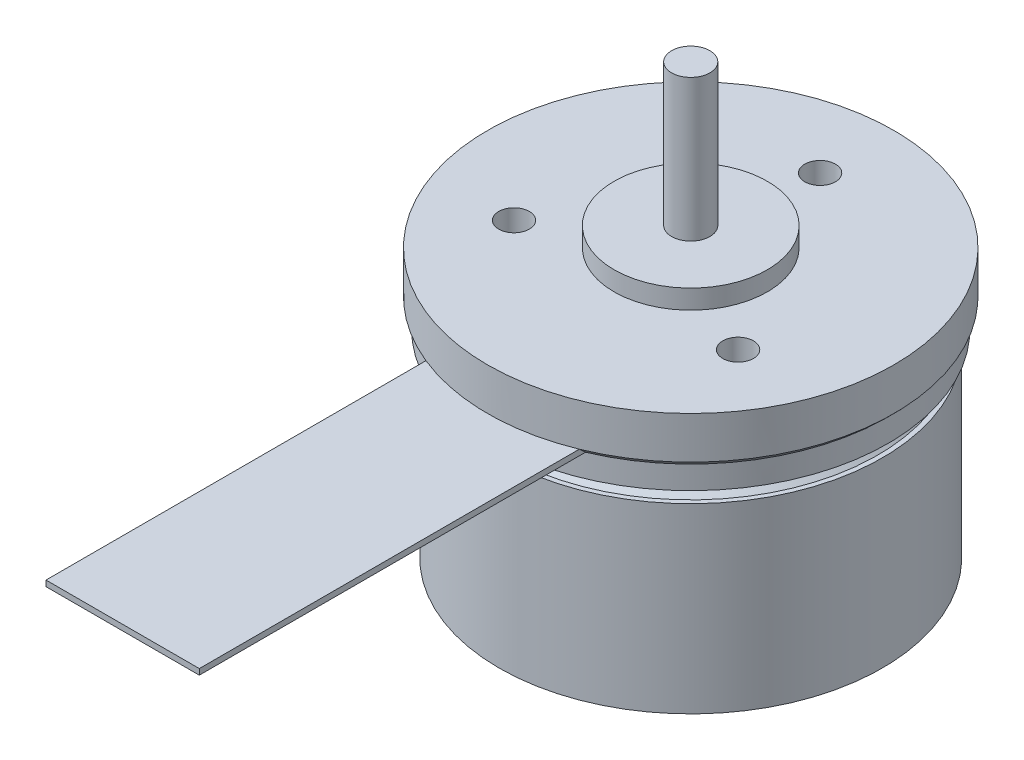
ISO-10303-21;
HEADER;
FILE_DESCRIPTION(('STEP AP214'),'2;1');
FILE_NAME('part.step','',(''),(''),'','','');
FILE_SCHEMA(('AUTOMOTIVE_DESIGN { 1 0 10303 214 1 1 1 1 }'));
ENDSEC;
DATA;
#1=APPLICATION_CONTEXT('core data for automotive mechanical design processes');
#2=APPLICATION_PROTOCOL_DEFINITION('international standard','automotive_design',2000,#1);
#3=PRODUCT_CONTEXT('',#1,'mechanical');
#4=PRODUCT('Part','Part','',(#3));
#5=PRODUCT_RELATED_PRODUCT_CATEGORY('part','',(#4));
#6=PRODUCT_DEFINITION_FORMATION('','',#4);
#7=PRODUCT_DEFINITION_CONTEXT('part definition',#1,'design');
#8=PRODUCT_DEFINITION('design','',#6,#7);
#9=PRODUCT_DEFINITION_SHAPE('','',#8);
#10=(LENGTH_UNIT() NAMED_UNIT(*) SI_UNIT(.MILLI.,.METRE.));
#11=(NAMED_UNIT(*) PLANE_ANGLE_UNIT() SI_UNIT($,.RADIAN.));
#12=(NAMED_UNIT(*) SI_UNIT($,.STERADIAN.) SOLID_ANGLE_UNIT());
#13=UNCERTAINTY_MEASURE_WITH_UNIT(LENGTH_MEASURE(1.E-05),#10,'distance_accuracy_value','');
#14=(GEOMETRIC_REPRESENTATION_CONTEXT(3) GLOBAL_UNCERTAINTY_ASSIGNED_CONTEXT((#13)) GLOBAL_UNIT_ASSIGNED_CONTEXT((#10,
#11,#12)) REPRESENTATION_CONTEXT('',''));
#15=CARTESIAN_POINT('',(0.,0.,0.));
#16=DIRECTION('',(0.,0.,1.));
#17=DIRECTION('',(1.,0.,0.));
#18=AXIS2_PLACEMENT_3D('',#15,#16,#17);
#19=CARTESIAN_POINT('',(0.,2.2,0.));
#20=DIRECTION('',(0.,-1.,0.));
#21=DIRECTION('',(0.,0.,-1.));
#22=AXIS2_PLACEMENT_3D('',#19,#20,#21);
#23=CYLINDRICAL_SURFACE('',#22,10.6);
#24=CARTESIAN_POINT('',(0.,2.2,0.));
#25=DIRECTION('',(0.,1.,0.));
#26=DIRECTION('',(0.,0.,1.));
#27=AXIS2_PLACEMENT_3D('',#24,#25,#26);
#28=CIRCLE('',#27,10.6);
#29=CARTESIAN_POINT('',(0.,2.2,10.6));
#30=VERTEX_POINT('',#29);
#31=EDGE_CURVE('E197',#30,#30,#28,.T.);
#32=ORIENTED_EDGE('',*,*,#31,.F.);
#33=EDGE_LOOP('',(#32));
#34=FACE_BOUND('',#33,.T.);
#35=CARTESIAN_POINT('',(0.,0.,0.));
#36=DIRECTION('',(0.,1.,0.));
#37=DIRECTION('',(0.,0.,1.));
#38=AXIS2_PLACEMENT_3D('',#35,#36,#37);
#39=CIRCLE('',#38,10.6);
#40=CARTESIAN_POINT('',(4.,0.,9.81631295344642));
#41=VERTEX_POINT('',#40);
#42=CARTESIAN_POINT('',(-4.,0.,9.81631295344643));
#43=VERTEX_POINT('',#42);
#44=EDGE_CURVE('E168',#41,#43,#39,.T.);
#45=ORIENTED_EDGE('',*,*,#44,.T.);
#46=EDGE_CURVE('E167',#43,#41,#39,.T.);
#47=ORIENTED_EDGE('',*,*,#46,.T.);
#48=EDGE_LOOP('',(#45,#47));
#49=FACE_BOUND('',#48,.T.);
#50=ADVANCED_FACE('F42',(#34,#49),#23,.T.);
#51=CARTESIAN_POINT('',(5.84567147554539,2.2,3.37499999999975));
#52=DIRECTION('',(0.,-1.,0.));
#53=DIRECTION('',(0.,0.,-1.));
#54=AXIS2_PLACEMENT_3D('',#51,#52,#53);
#55=CYLINDRICAL_SURFACE('',#54,0.800000000000371);
#56=CARTESIAN_POINT('',(5.84567147554539,2.2,3.37499999999975));
#57=DIRECTION('',(0.,1.,0.));
#58=DIRECTION('',(0.,0.,1.));
#59=AXIS2_PLACEMENT_3D('',#56,#57,#58);
#60=CIRCLE('',#59,0.800000000000371);
#61=CARTESIAN_POINT('',(5.84567147554539,2.2,4.17500000000012));
#62=VERTEX_POINT('',#61);
#63=EDGE_CURVE('E193',#62,#62,#60,.T.);
#64=ORIENTED_EDGE('',*,*,#63,.T.);
#65=EDGE_LOOP('',(#64));
#66=FACE_BOUND('',#65,.T.);
#67=CARTESIAN_POINT('',(5.84567147554539,0.,3.37499999999975));
#68=DIRECTION('',(0.,1.,0.));
#69=DIRECTION('',(0.,0.,1.));
#70=AXIS2_PLACEMENT_3D('',#67,#68,#69);
#71=CIRCLE('',#70,0.800000000000371);
#72=CARTESIAN_POINT('',(5.84567147554539,0.,4.17500000000012));
#73=VERTEX_POINT('',#72);
#74=EDGE_CURVE('E190',#73,#73,#71,.T.);
#75=ORIENTED_EDGE('',*,*,#74,.F.);
#76=EDGE_LOOP('',(#75));
#77=FACE_BOUND('',#76,.T.);
#78=ADVANCED_FACE('F274',(#66,#77),#55,.F.);
#79=CARTESIAN_POINT('',(0.,2.2,-6.75));
#80=DIRECTION('',(0.,-1.,0.));
#81=DIRECTION('',(0.,0.,-1.));
#82=AXIS2_PLACEMENT_3D('',#79,#80,#81);
#83=CYLINDRICAL_SURFACE('',#82,0.8);
#84=CARTESIAN_POINT('',(0.,2.2,-6.75));
#85=DIRECTION('',(0.,1.,0.));
#86=DIRECTION('',(0.,0.,1.));
#87=AXIS2_PLACEMENT_3D('',#84,#85,#86);
#88=CIRCLE('',#87,0.8);
#89=CARTESIAN_POINT('',(0.,2.2,-5.95));
#90=VERTEX_POINT('',#89);
#91=EDGE_CURVE('E189',#90,#90,#88,.T.);
#92=ORIENTED_EDGE('',*,*,#91,.T.);
#93=EDGE_LOOP('',(#92));
#94=FACE_BOUND('',#93,.T.);
#95=CARTESIAN_POINT('',(0.,0.,-6.75));
#96=DIRECTION('',(0.,1.,0.));
#97=DIRECTION('',(0.,0.,1.));
#98=AXIS2_PLACEMENT_3D('',#95,#96,#97);
#99=CIRCLE('',#98,0.8);
#100=CARTESIAN_POINT('',(0.,0.,-5.95));
#101=VERTEX_POINT('',#100);
#102=EDGE_CURVE('E207',#101,#101,#99,.T.);
#103=ORIENTED_EDGE('',*,*,#102,.F.);
#104=EDGE_LOOP('',(#103));
#105=FACE_BOUND('',#104,.T.);
#106=ADVANCED_FACE('F280',(#94,#105),#83,.F.);
#107=CARTESIAN_POINT('',(-5.84567147554453,2.2,3.37500000000025));
#108=DIRECTION('',(0.,-1.,0.));
#109=DIRECTION('',(0.,0.,-1.));
#110=AXIS2_PLACEMENT_3D('',#107,#108,#109);
#111=CYLINDRICAL_SURFACE('',#110,0.800000000000547);
#112=CARTESIAN_POINT('',(-5.84567147554453,2.2,3.37500000000025));
#113=DIRECTION('',(0.,1.,0.));
#114=DIRECTION('',(0.,0.,1.));
#115=AXIS2_PLACEMENT_3D('',#112,#113,#114);
#116=CIRCLE('',#115,0.800000000000547);
#117=CARTESIAN_POINT('',(-5.84567147554453,2.2,4.1750000000008));
#118=VERTEX_POINT('',#117);
#119=EDGE_CURVE('E185',#118,#118,#116,.T.);
#120=ORIENTED_EDGE('',*,*,#119,.T.);
#121=EDGE_LOOP('',(#120));
#122=FACE_BOUND('',#121,.T.);
#123=CARTESIAN_POINT('',(-5.84567147554453,0.,3.37500000000025));
#124=DIRECTION('',(0.,1.,0.));
#125=DIRECTION('',(0.,0.,1.));
#126=AXIS2_PLACEMENT_3D('',#123,#124,#125);
#127=CIRCLE('',#126,0.800000000000547);
#128=CARTESIAN_POINT('',(-5.84567147554453,0.,4.1750000000008));
#129=VERTEX_POINT('',#128);
#130=EDGE_CURVE('E184',#129,#129,#127,.T.);
#131=ORIENTED_EDGE('',*,*,#130,.F.);
#132=EDGE_LOOP('',(#131));
#133=FACE_BOUND('',#132,.T.);
#134=ADVANCED_FACE('F44',(#122,#133),#111,.F.);
#135=CARTESIAN_POINT('',(0.,2.2,0.));
#136=DIRECTION('',(0.,1.,0.));
#137=DIRECTION('',(0.,0.,1.));
#138=AXIS2_PLACEMENT_3D('',#135,#136,#137);
#139=PLANE('',#138);
#140=ORIENTED_EDGE('',*,*,#119,.F.);
#141=EDGE_LOOP('',(#140));
#142=FACE_BOUND('',#141,.T.);
#143=ORIENTED_EDGE('',*,*,#91,.F.);
#144=EDGE_LOOP('',(#143));
#145=FACE_BOUND('',#144,.T.);
#146=ORIENTED_EDGE('',*,*,#63,.F.);
#147=EDGE_LOOP('',(#146));
#148=FACE_BOUND('',#147,.T.);
#149=ORIENTED_EDGE('',*,*,#31,.T.);
#150=EDGE_LOOP('',(#149));
#151=FACE_BOUND('',#150,.T.);
#152=CARTESIAN_POINT('',(0.,2.2,0.));
#153=DIRECTION('',(0.,1.,0.));
#154=DIRECTION('',(0.,0.,1.));
#155=AXIS2_PLACEMENT_3D('',#152,#153,#154);
#156=CIRCLE('',#155,4.);
#157=CARTESIAN_POINT('',(0.,2.2,4.));
#158=VERTEX_POINT('',#157);
#159=EDGE_CURVE('E201',#158,#158,#156,.T.);
#160=ORIENTED_EDGE('',*,*,#159,.F.);
#161=EDGE_LOOP('',(#160));
#162=FACE_BOUND('',#161,.T.);
#163=ADVANCED_FACE('F286',(#142,#145,#148,#151,#162),#139,.T.);
#164=CARTESIAN_POINT('',(0.,3.2,0.));
#165=DIRECTION('',(0.,-1.,0.));
#166=DIRECTION('',(0.,0.,-1.));
#167=AXIS2_PLACEMENT_3D('',#164,#165,#166);
#168=CYLINDRICAL_SURFACE('',#167,4.);
#169=ORIENTED_EDGE('',*,*,#159,.T.);
#170=EDGE_LOOP('',(#169));
#171=FACE_BOUND('',#170,.T.);
#172=CARTESIAN_POINT('',(0.,3.2,0.));
#173=DIRECTION('',(0.,1.,0.));
#174=DIRECTION('',(0.,0.,1.));
#175=AXIS2_PLACEMENT_3D('',#172,#173,#174);
#176=CIRCLE('',#175,4.);
#177=CARTESIAN_POINT('',(0.,3.2,4.));
#178=VERTEX_POINT('',#177);
#179=EDGE_CURVE('E180',#178,#178,#176,.T.);
#180=ORIENTED_EDGE('',*,*,#179,.F.);
#181=EDGE_LOOP('',(#180));
#182=FACE_BOUND('',#181,.T.);
#183=ADVANCED_FACE('F317',(#171,#182),#168,.T.);
#184=CARTESIAN_POINT('',(0.,3.2,0.));
#185=DIRECTION('',(0.,1.,0.));
#186=DIRECTION('',(0.,0.,1.));
#187=AXIS2_PLACEMENT_3D('',#184,#185,#186);
#188=PLANE('',#187);
#189=CARTESIAN_POINT('',(0.,3.2,0.));
#190=DIRECTION('',(0.,1.,0.));
#191=DIRECTION('',(0.,0.,1.));
#192=AXIS2_PLACEMENT_3D('',#189,#190,#191);
#193=CIRCLE('',#192,1.);
#194=CARTESIAN_POINT('',(0.,3.2,1.));
#195=VERTEX_POINT('',#194);
#196=EDGE_CURVE('E176',#195,#195,#193,.T.);
#197=ORIENTED_EDGE('',*,*,#196,.F.);
#198=EDGE_LOOP('',(#197));
#199=FACE_BOUND('',#198,.T.);
#200=ORIENTED_EDGE('',*,*,#179,.T.);
#201=EDGE_LOOP('',(#200));
#202=FACE_BOUND('',#201,.T.);
#203=ADVANCED_FACE('F311',(#199,#202),#188,.T.);
#204=CARTESIAN_POINT('',(0.,10.6,0.));
#205=DIRECTION('',(0.,1.,0.));
#206=DIRECTION('',(0.,0.,1.));
#207=AXIS2_PLACEMENT_3D('',#204,#205,#206);
#208=PLANE('',#207);
#209=CARTESIAN_POINT('',(0.,10.6,0.));
#210=DIRECTION('',(0.,1.,0.));
#211=DIRECTION('',(0.,0.,1.));
#212=AXIS2_PLACEMENT_3D('',#209,#210,#211);
#213=CIRCLE('',#212,1.);
#214=CARTESIAN_POINT('',(0.,10.6,1.));
#215=VERTEX_POINT('',#214);
#216=EDGE_CURVE('E172',#215,#215,#213,.T.);
#217=ORIENTED_EDGE('',*,*,#216,.T.);
#218=EDGE_LOOP('',(#217));
#219=FACE_BOUND('',#218,.T.);
#220=ADVANCED_FACE('F308',(#219),#208,.T.);
#221=CARTESIAN_POINT('',(0.,10.6,0.));
#222=DIRECTION('',(0.,-1.,0.));
#223=DIRECTION('',(0.,0.,-1.));
#224=AXIS2_PLACEMENT_3D('',#221,#222,#223);
#225=CYLINDRICAL_SURFACE('',#224,1.);
#226=ORIENTED_EDGE('',*,*,#196,.T.);
#227=EDGE_LOOP('',(#226));
#228=FACE_BOUND('',#227,.T.);
#229=ORIENTED_EDGE('',*,*,#216,.F.);
#230=EDGE_LOOP('',(#229));
#231=FACE_BOUND('',#230,.T.);
#232=ADVANCED_FACE('F231',(#228,#231),#225,.T.);
#233=CARTESIAN_POINT('',(0.,-11.9,-1.));
#234=DIRECTION('',(0.,1.,0.));
#235=DIRECTION('',(0.,0.,1.));
#236=AXIS2_PLACEMENT_3D('',#233,#234,#235);
#237=PLANE('',#236);
#238=CARTESIAN_POINT('',(0.,-11.9,0.));
#239=DIRECTION('',(0.,1.,0.));
#240=DIRECTION('',(0.,0.,1.));
#241=AXIS2_PLACEMENT_3D('',#238,#239,#240);
#242=CIRCLE('',#241,1.);
#243=CARTESIAN_POINT('',(0.,-11.9,0.999999999999999));
#244=VERTEX_POINT('',#243);
#245=EDGE_CURVE('E125',#244,#244,#242,.T.);
#246=ORIENTED_EDGE('',*,*,#245,.F.);
#247=EDGE_LOOP('',(#246));
#248=FACE_BOUND('',#247,.T.);
#249=ADVANCED_FACE('F227',(#248),#237,.F.);
#250=CARTESIAN_POINT('',(0.,0.,0.));
#251=DIRECTION('',(0.,1.,0.));
#252=DIRECTION('',(0.,0.,1.));
#253=AXIS2_PLACEMENT_3D('',#250,#251,#252);
#254=CYLINDRICAL_SURFACE('',#253,1.);
#255=CARTESIAN_POINT('',(0.,-11.8,0.));
#256=DIRECTION('',(0.,1.,0.));
#257=DIRECTION('',(0.,0.,1.));
#258=AXIS2_PLACEMENT_3D('',#255,#256,#257);
#259=CIRCLE('',#258,1.);
#260=CARTESIAN_POINT('',(0.,-11.8,0.999999999999999));
#261=VERTEX_POINT('',#260);
#262=EDGE_CURVE('E130',#261,#261,#259,.T.);
#263=ORIENTED_EDGE('',*,*,#262,.F.);
#264=EDGE_LOOP('',(#263));
#265=FACE_BOUND('',#264,.T.);
#266=ORIENTED_EDGE('',*,*,#245,.T.);
#267=EDGE_LOOP('',(#266));
#268=FACE_BOUND('',#267,.T.);
#269=ADVANCED_FACE('F230',(#265,#268),#254,.T.);
#270=CARTESIAN_POINT('',(0.,-11.8,-10.));
#271=DIRECTION('',(0.,1.,0.));
#272=DIRECTION('',(0.,0.,1.));
#273=AXIS2_PLACEMENT_3D('',#270,#271,#272);
#274=PLANE('',#273);
#275=CARTESIAN_POINT('',(0.,-11.8,0.));
#276=DIRECTION('',(0.,1.,0.));
#277=DIRECTION('',(0.,0.,1.));
#278=AXIS2_PLACEMENT_3D('',#275,#276,#277);
#279=CIRCLE('',#278,10.);
#280=CARTESIAN_POINT('',(0.,-11.8,10.));
#281=VERTEX_POINT('',#280);
#282=EDGE_CURVE('E134',#281,#281,#279,.T.);
#283=ORIENTED_EDGE('',*,*,#282,.F.);
#284=EDGE_LOOP('',(#283));
#285=FACE_BOUND('',#284,.T.);
#286=ORIENTED_EDGE('',*,*,#262,.T.);
#287=EDGE_LOOP('',(#286));
#288=FACE_BOUND('',#287,.T.);
#289=ADVANCED_FACE('F235',(#285,#288),#274,.F.);
#290=CARTESIAN_POINT('',(0.,0.,0.));
#291=DIRECTION('',(0.,1.,0.));
#292=DIRECTION('',(0.,0.,1.));
#293=AXIS2_PLACEMENT_3D('',#290,#291,#292);
#294=CYLINDRICAL_SURFACE('',#293,10.);
#295=CARTESIAN_POINT('',(0.,-2.3,0.));
#296=DIRECTION('',(0.,1.,0.));
#297=DIRECTION('',(0.,0.,1.));
#298=AXIS2_PLACEMENT_3D('',#295,#296,#297);
#299=CIRCLE('',#298,10.);
#300=CARTESIAN_POINT('',(0.,-2.3,10.));
#301=VERTEX_POINT('',#300);
#302=EDGE_CURVE('E138',#301,#301,#299,.T.);
#303=ORIENTED_EDGE('',*,*,#302,.F.);
#304=EDGE_LOOP('',(#303));
#305=FACE_BOUND('',#304,.T.);
#306=ORIENTED_EDGE('',*,*,#282,.T.);
#307=EDGE_LOOP('',(#306));
#308=FACE_BOUND('',#307,.T.);
#309=ADVANCED_FACE('F239',(#305,#308),#294,.T.);
#310=CARTESIAN_POINT('',(0.,-2.3,-9.75690672582635));
#311=DIRECTION('',(0.,-1.,0.));
#312=DIRECTION('',(0.,0.,-1.));
#313=AXIS2_PLACEMENT_3D('',#310,#311,#312);
#314=PLANE('',#313);
#315=CARTESIAN_POINT('',(0.,-2.3,0.));
#316=DIRECTION('',(0.,1.,0.));
#317=DIRECTION('',(0.,0.,1.));
#318=AXIS2_PLACEMENT_3D('',#315,#316,#317);
#319=CIRCLE('',#318,9.75690672582635);
#320=CARTESIAN_POINT('',(0.,-2.3,9.75690672582635));
#321=VERTEX_POINT('',#320);
#322=EDGE_CURVE('E142',#321,#321,#319,.T.);
#323=ORIENTED_EDGE('',*,*,#322,.F.);
#324=EDGE_LOOP('',(#323));
#325=FACE_BOUND('',#324,.T.);
#326=ORIENTED_EDGE('',*,*,#302,.T.);
#327=EDGE_LOOP('',(#326));
#328=FACE_BOUND('',#327,.T.);
#329=ADVANCED_FACE('F243',(#325,#328),#314,.F.);
#330=CARTESIAN_POINT('',(0.,-2.3,0.));
#331=DIRECTION('',(0.,-1.,0.));
#332=DIRECTION('',(0.,0.,-1.));
#333=AXIS2_PLACEMENT_3D('',#330,#331,#332);
#334=CONICAL_SURFACE('',#333,9.75690672582635,0.785398163397448);
#335=CARTESIAN_POINT('',(0.,-2.,0.));
#336=DIRECTION('',(0.,1.,0.));
#337=DIRECTION('',(0.,0.,1.));
#338=AXIS2_PLACEMENT_3D('',#335,#336,#337);
#339=CIRCLE('',#338,9.45690672582635);
#340=CARTESIAN_POINT('',(0.,-2.,9.45690672582635));
#341=VERTEX_POINT('',#340);
#342=EDGE_CURVE('E146',#341,#341,#339,.T.);
#343=ORIENTED_EDGE('',*,*,#342,.F.);
#344=EDGE_LOOP('',(#343));
#345=FACE_BOUND('',#344,.T.);
#346=ORIENTED_EDGE('',*,*,#322,.T.);
#347=EDGE_LOOP('',(#346));
#348=FACE_BOUND('',#347,.T.);
#349=ADVANCED_FACE('F247',(#345,#348),#334,.T.);
#350=CARTESIAN_POINT('',(0.,-2.,-8.70622131579057));
#351=DIRECTION('',(0.,-1.,0.));
#352=DIRECTION('',(0.,0.,-1.));
#353=AXIS2_PLACEMENT_3D('',#350,#351,#352);
#354=PLANE('',#353);
#355=CARTESIAN_POINT('',(0.,-2.,0.));
#356=DIRECTION('',(0.,1.,0.));
#357=DIRECTION('',(0.,0.,1.));
#358=AXIS2_PLACEMENT_3D('',#355,#356,#357);
#359=CIRCLE('',#358,8.70622131579057);
#360=CARTESIAN_POINT('',(0.,-2.,8.70622131579057));
#361=VERTEX_POINT('',#360);
#362=EDGE_CURVE('E150',#361,#361,#359,.T.);
#363=ORIENTED_EDGE('',*,*,#362,.F.);
#364=EDGE_LOOP('',(#363));
#365=FACE_BOUND('',#364,.T.);
#366=ORIENTED_EDGE('',*,*,#342,.T.);
#367=EDGE_LOOP('',(#366));
#368=FACE_BOUND('',#367,.T.);
#369=ADVANCED_FACE('F251',(#365,#368),#354,.F.);
#370=CARTESIAN_POINT('',(0.,0.,0.));
#371=DIRECTION('',(0.,1.,0.));
#372=DIRECTION('',(0.,0.,1.));
#373=AXIS2_PLACEMENT_3D('',#370,#371,#372);
#374=CYLINDRICAL_SURFACE('',#373,8.70622131579057);
#375=CARTESIAN_POINT('',(0.,-1.5,0.));
#376=DIRECTION('',(0.,1.,0.));
#377=DIRECTION('',(0.,0.,1.));
#378=AXIS2_PLACEMENT_3D('',#375,#376,#377);
#379=CIRCLE('',#378,8.70622131579057);
#380=CARTESIAN_POINT('',(0.,-1.5,8.70622131579057));
#381=VERTEX_POINT('',#380);
#382=EDGE_CURVE('E154',#381,#381,#379,.T.);
#383=ORIENTED_EDGE('',*,*,#382,.F.);
#384=EDGE_LOOP('',(#383));
#385=FACE_BOUND('',#384,.T.);
#386=ORIENTED_EDGE('',*,*,#362,.T.);
#387=EDGE_LOOP('',(#386));
#388=FACE_BOUND('',#387,.T.);
#389=ADVANCED_FACE('F255',(#385,#388),#374,.T.);
#390=CARTESIAN_POINT('',(0.,-1.5,-10.3));
#391=DIRECTION('',(0.,1.,0.));
#392=DIRECTION('',(0.,0.,1.));
#393=AXIS2_PLACEMENT_3D('',#390,#391,#392);
#394=PLANE('',#393);
#395=CARTESIAN_POINT('',(0.,-1.5,0.));
#396=DIRECTION('',(0.,1.,0.));
#397=DIRECTION('',(0.,0.,1.));
#398=AXIS2_PLACEMENT_3D('',#395,#396,#397);
#399=CIRCLE('',#398,10.3);
#400=CARTESIAN_POINT('',(0.,-1.5,10.3));
#401=VERTEX_POINT('',#400);
#402=EDGE_CURVE('E158',#401,#401,#399,.T.);
#403=ORIENTED_EDGE('',*,*,#402,.F.);
#404=EDGE_LOOP('',(#403));
#405=FACE_BOUND('',#404,.T.);
#406=ORIENTED_EDGE('',*,*,#382,.T.);
#407=EDGE_LOOP('',(#406));
#408=FACE_BOUND('',#407,.T.);
#409=ADVANCED_FACE('F259',(#405,#408),#394,.F.);
#410=CARTESIAN_POINT('',(0.,0.,0.));
#411=DIRECTION('',(0.,1.,0.));
#412=DIRECTION('',(0.,0.,1.));
#413=AXIS2_PLACEMENT_3D('',#410,#411,#412);
#414=CYLINDRICAL_SURFACE('',#413,10.3);
#415=CARTESIAN_POINT('',(0.,-0.3,0.));
#416=DIRECTION('',(0.,1.,0.));
#417=DIRECTION('',(0.,0.,1.));
#418=AXIS2_PLACEMENT_3D('',#415,#416,#417);
#419=CIRCLE('',#418,10.3);
#420=CARTESIAN_POINT('',(4.,-0.3,9.49157521173383));
#421=VERTEX_POINT('',#420);
#422=CARTESIAN_POINT('',(-4.,-0.3,9.49157521173383));
#423=VERTEX_POINT('',#422);
#424=EDGE_CURVE('E163',#421,#423,#419,.T.);
#425=ORIENTED_EDGE('',*,*,#424,.F.);
#426=EDGE_CURVE('E162',#423,#421,#419,.T.);
#427=ORIENTED_EDGE('',*,*,#426,.F.);
#428=EDGE_LOOP('',(#425,#427));
#429=FACE_BOUND('',#428,.T.);
#430=ORIENTED_EDGE('',*,*,#402,.T.);
#431=EDGE_LOOP('',(#430));
#432=FACE_BOUND('',#431,.T.);
#433=ADVANCED_FACE('F262',(#429,#432),#414,.T.);
#434=CARTESIAN_POINT('',(0.,-0.3,0.));
#435=DIRECTION('',(0.,1.,0.));
#436=DIRECTION('',(0.,0.,1.));
#437=AXIS2_PLACEMENT_3D('',#434,#435,#436);
#438=CONICAL_SURFACE('',#437,10.3,0.785398163397448);
#439=ORIENTED_EDGE('',*,*,#44,.F.);
#440=CARTESIAN_POINT('',(4.,1.81564514916048,11.7536481345101));
#441=CARTESIAN_POINT('',(4.,1.65072161625127,11.5794331931443));
#442=CARTESIAN_POINT('',(4.,1.48599610774751,11.4050307171514));
#443=CARTESIAN_POINT('',(4.,1.15700321275247,11.0557933237763));
#444=CARTESIAN_POINT('',(4.,0.992735827550353,10.8809584051798));
#445=CARTESIAN_POINT('',(4.,0.500739127811526,10.3557457733419));
#446=CARTESIAN_POINT('',(4.,0.173791346960916,10.004634949778));
#447=CARTESIAN_POINT('',(4.,-0.477331738547946,9.29982112053421));
#448=CARTESIAN_POINT('',(4.,-0.801506936022224,8.94611801561334));
#449=CARTESIAN_POINT('',(4.,-1.28487535036775,8.41291585195685));
#450=CARTESIAN_POINT('',(4.,-1.44552134731391,8.23473424428099));
#451=CARTESIAN_POINT('',(4.,-1.76564217557527,7.87731831894331));
#452=CARTESIAN_POINT('',(4.,-1.92511699179592,7.69808398776704));
#453=CARTESIAN_POINT('',(4.,-2.08390291477242,7.51823846156952));
#454=B_SPLINE_CURVE_WITH_KNOTS('',3,(#440,#441,#442,#443,#444,#445,#446,#447,#448,#449,#450,
#451,#452,#453),.UNSPECIFIED.,.F.,.F.,(4,2,2,2,2,2,4),(0.,0.719691121179947,1.43938426550986,
2.8786662419556,4.31800360967561,5.0377228310917,5.75745131225156),.UNSPECIFIED.);
#455=EDGE_CURVE('E11',#41,#421,#454,.T.);
#456=ORIENTED_EDGE('',*,*,#455,.T.);
#457=ORIENTED_EDGE('',*,*,#424,.T.);
#458=CARTESIAN_POINT('',(-4.,-2.08390291477242,7.51823846156952));
#459=CARTESIAN_POINT('',(-4.,-1.92511699179593,7.69808398776705));
#460=CARTESIAN_POINT('',(-4.,-1.76564217557527,7.87731831894331));
#461=CARTESIAN_POINT('',(-4.,-1.44552134731391,8.23473424428099));
#462=CARTESIAN_POINT('',(-4.,-1.28487535036775,8.41291585195685));
#463=CARTESIAN_POINT('',(-4.,-0.801506936022228,8.94611801561334));
#464=CARTESIAN_POINT('',(-4.,-0.47733173854796,9.29982112053422));
#465=CARTESIAN_POINT('',(-4.,0.173791346960902,10.004634949778));
#466=CARTESIAN_POINT('',(-4.,0.500739127811523,10.3557457733419));
#467=CARTESIAN_POINT('',(-4.,0.992735827550354,10.8809584051798));
#468=CARTESIAN_POINT('',(-4.,1.15700321275247,11.0557933237763));
#469=CARTESIAN_POINT('',(-4.,1.48599610774751,11.4050307171514));
#470=CARTESIAN_POINT('',(-4.,1.65072161625127,11.5794331931443));
#471=CARTESIAN_POINT('',(-4.,1.81564514916048,11.7536481345101));
#472=B_SPLINE_CURVE_WITH_KNOTS('',3,(#458,#459,#460,#461,#462,#463,#464,#465,#466,#467,#468,
#469,#470,#471),.UNSPECIFIED.,.F.,.F.,(4,2,2,2,2,2,4),(0.,0.719728481159867,1.43944770257595,
2.87878507029597,4.3180670467417,5.03776019107162,5.75745131225156),.UNSPECIFIED.);
#473=EDGE_CURVE('E56',#423,#43,#472,.T.);
#474=ORIENTED_EDGE('',*,*,#473,.T.);
#475=EDGE_LOOP('',(#439,#456,#457,#474));
#476=FACE_BOUND('',#475,.T.);
#477=ADVANCED_FACE('F218',(#476),#438,.T.);
#478=CARTESIAN_POINT('',(0.,0.,0.));
#479=DIRECTION('',(0.,-1.,0.));
#480=DIRECTION('',(0.,0.,-1.));
#481=AXIS2_PLACEMENT_3D('',#478,#479,#480);
#482=PLANE('',#481);
#483=ORIENTED_EDGE('',*,*,#130,.T.);
#484=EDGE_LOOP('',(#483));
#485=FACE_BOUND('',#484,.T.);
#486=ADVANCED_FACE('F269',(#485),#482,.F.);
#487=ORIENTED_EDGE('',*,*,#102,.T.);
#488=EDGE_LOOP('',(#487));
#489=FACE_BOUND('',#488,.T.);
#490=ADVANCED_FACE('F298',(#489),#482,.F.);
#491=ORIENTED_EDGE('',*,*,#74,.T.);
#492=EDGE_LOOP('',(#491));
#493=FACE_BOUND('',#492,.T.);
#494=ADVANCED_FACE('F300',(#493),#482,.F.);
#495=CARTESIAN_POINT('',(4.,-0.3,29.6411962840195));
#496=DIRECTION('',(1.,0.,0.));
#497=DIRECTION('',(0.,1.,0.));
#498=AXIS2_PLACEMENT_3D('',#495,#496,#497);
#499=PLANE('',#498);
#500=ORIENTED_EDGE('',*,*,#455,.F.);
#501=DIRECTION('',(0.,0.,-1.));
#502=VECTOR('',#501,1.);
#503=CARTESIAN_POINT('',(4.,0.,29.6411962840195));
#504=LINE('',#503,#502);
#505=CARTESIAN_POINT('',(4.,0.,29.6411962840195));
#506=VERTEX_POINT('',#505);
#507=EDGE_CURVE('E63',#506,#41,#504,.T.);
#508=ORIENTED_EDGE('',*,*,#507,.F.);
#509=DIRECTION('',(0.,1.,0.));
#510=VECTOR('',#509,1.);
#511=CARTESIAN_POINT('',(4.,-0.3,29.6411962840195));
#512=LINE('',#511,#510);
#513=CARTESIAN_POINT('',(4.,-0.3,29.6411962840195));
#514=VERTEX_POINT('',#513);
#515=EDGE_CURVE('E105',#514,#506,#512,.T.);
#516=ORIENTED_EDGE('',*,*,#515,.F.);
#517=DIRECTION('',(0.,0.,-1.));
#518=VECTOR('',#517,1.);
#519=CARTESIAN_POINT('',(4.,-0.3,29.6411962840195));
#520=LINE('',#519,#518);
#521=EDGE_CURVE('E106',#514,#421,#520,.T.);
#522=ORIENTED_EDGE('',*,*,#521,.T.);
#523=EDGE_LOOP('',(#500,#508,#516,#522));
#524=FACE_BOUND('',#523,.T.);
#525=ADVANCED_FACE('F226',(#524),#499,.T.);
#526=CARTESIAN_POINT('',(-4.,-0.3,9.08096849739523));
#527=DIRECTION('',(-1.,0.,0.));
#528=DIRECTION('',(0.,0.,1.));
#529=AXIS2_PLACEMENT_3D('',#526,#527,#528);
#530=PLANE('',#529);
#531=ORIENTED_EDGE('',*,*,#473,.F.);
#532=DIRECTION('',(0.,0.,1.));
#533=VECTOR('',#532,1.);
#534=CARTESIAN_POINT('',(-4.,-0.3,9.08096849739523));
#535=LINE('',#534,#533);
#536=CARTESIAN_POINT('',(-4.,-0.3,29.6411962840195));
#537=VERTEX_POINT('',#536);
#538=EDGE_CURVE('E88',#423,#537,#535,.T.);
#539=ORIENTED_EDGE('',*,*,#538,.T.);
#540=DIRECTION('',(0.,1.,0.));
#541=VECTOR('',#540,1.);
#542=CARTESIAN_POINT('',(-4.,-0.3,29.6411962840195));
#543=LINE('',#542,#541);
#544=CARTESIAN_POINT('',(-4.,0.,29.6411962840195));
#545=VERTEX_POINT('',#544);
#546=EDGE_CURVE('E91',#537,#545,#543,.T.);
#547=ORIENTED_EDGE('',*,*,#546,.T.);
#548=DIRECTION('',(0.,0.,1.));
#549=VECTOR('',#548,1.);
#550=CARTESIAN_POINT('',(-4.,0.,9.08096849739523));
#551=LINE('',#550,#549);
#552=EDGE_CURVE('E117',#43,#545,#551,.T.);
#553=ORIENTED_EDGE('',*,*,#552,.F.);
#554=EDGE_LOOP('',(#531,#539,#547,#553));
#555=FACE_BOUND('',#554,.T.);
#556=ADVANCED_FACE('F90',(#555),#530,.T.);
#557=CARTESIAN_POINT('',(0.,-0.3,0.));
#558=DIRECTION('',(0.,1.,0.));
#559=DIRECTION('',(-1.,0.,0.));
#560=AXIS2_PLACEMENT_3D('',#557,#558,#559);
#561=PLANE('',#560);
#562=ORIENTED_EDGE('',*,*,#538,.F.);
#563=ORIENTED_EDGE('',*,*,#426,.T.);
#564=ORIENTED_EDGE('',*,*,#521,.F.);
#565=DIRECTION('',(1.,0.,0.));
#566=VECTOR('',#565,1.);
#567=CARTESIAN_POINT('',(-4.,-0.3,29.6411962840195));
#568=LINE('',#567,#566);
#569=EDGE_CURVE('E97',#537,#514,#568,.T.);
#570=ORIENTED_EDGE('',*,*,#569,.F.);
#571=EDGE_LOOP('',(#562,#563,#564,#570));
#572=FACE_BOUND('',#571,.T.);
#573=ADVANCED_FACE('F108',(#572),#561,.F.);
#574=CARTESIAN_POINT('',(0.,0.,0.));
#575=DIRECTION('',(0.,1.,0.));
#576=DIRECTION('',(-1.,0.,0.));
#577=AXIS2_PLACEMENT_3D('',#574,#575,#576);
#578=PLANE('',#577);
#579=ORIENTED_EDGE('',*,*,#46,.F.);
#580=ORIENTED_EDGE('',*,*,#552,.T.);
#581=DIRECTION('',(1.,0.,0.));
#582=VECTOR('',#581,1.);
#583=CARTESIAN_POINT('',(-4.,0.,29.6411962840195));
#584=LINE('',#583,#582);
#585=EDGE_CURVE('E103',#545,#506,#584,.T.);
#586=ORIENTED_EDGE('',*,*,#585,.T.);
#587=ORIENTED_EDGE('',*,*,#507,.T.);
#588=EDGE_LOOP('',(#579,#580,#586,#587));
#589=FACE_BOUND('',#588,.T.);
#590=ADVANCED_FACE('F400',(#589),#578,.T.);
#591=CARTESIAN_POINT('',(-4.,-0.3,29.6411962840195));
#592=DIRECTION('',(0.,0.,1.));
#593=DIRECTION('',(1.,0.,0.));
#594=AXIS2_PLACEMENT_3D('',#591,#592,#593);
#595=PLANE('',#594);
#596=ORIENTED_EDGE('',*,*,#585,.F.);
#597=ORIENTED_EDGE('',*,*,#546,.F.);
#598=ORIENTED_EDGE('',*,*,#569,.T.);
#599=ORIENTED_EDGE('',*,*,#515,.T.);
#600=EDGE_LOOP('',(#596,#597,#598,#599));
#601=FACE_BOUND('',#600,.T.);
#602=ADVANCED_FACE('F101',(#601),#595,.T.);
#603=CLOSED_SHELL('',(#50,#78,#106,#134,#163,#183,#203,#220,#232,#249,#269,#289,#309,#329,#349,
#369,#389,#409,#433,#477,#486,#490,#494,#525,#556,#573,#590,#602));
#604=MANIFOLD_SOLID_BREP('B2',#603);
#605=ADVANCED_BREP_SHAPE_REPRESENTATION('',(#18,#604),#14);
#606=SHAPE_DEFINITION_REPRESENTATION(#9,#605);
ENDSEC;
END-ISO-10303-21;
